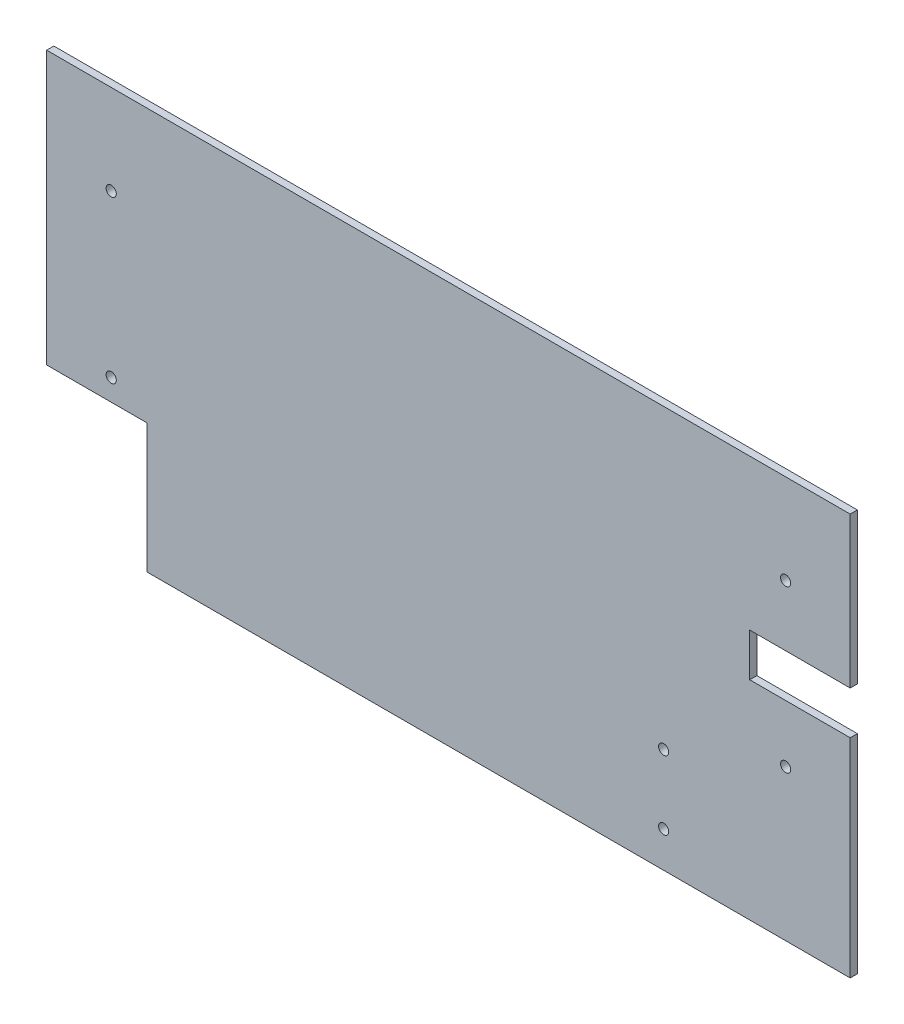
ISO-10303-21;
HEADER;
FILE_DESCRIPTION(('STEP AP214'),'2;1');
FILE_NAME('part.step','',(''),(''),'','','');
FILE_SCHEMA(('AUTOMOTIVE_DESIGN { 1 0 10303 214 1 1 1 1 }'));
ENDSEC;
DATA;
#1=APPLICATION_CONTEXT('core data for automotive mechanical design processes');
#2=APPLICATION_PROTOCOL_DEFINITION('international standard','automotive_design',2000,#1);
#3=PRODUCT_CONTEXT('',#1,'mechanical');
#4=PRODUCT('Part','Part','',(#3));
#5=PRODUCT_RELATED_PRODUCT_CATEGORY('part','',(#4));
#6=PRODUCT_DEFINITION_FORMATION('','',#4);
#7=PRODUCT_DEFINITION_CONTEXT('part definition',#1,'design');
#8=PRODUCT_DEFINITION('design','',#6,#7);
#9=PRODUCT_DEFINITION_SHAPE('','',#8);
#10=(LENGTH_UNIT() NAMED_UNIT(*) SI_UNIT(.MILLI.,.METRE.));
#11=(NAMED_UNIT(*) PLANE_ANGLE_UNIT() SI_UNIT($,.RADIAN.));
#12=(NAMED_UNIT(*) SI_UNIT($,.STERADIAN.) SOLID_ANGLE_UNIT());
#13=UNCERTAINTY_MEASURE_WITH_UNIT(LENGTH_MEASURE(1.E-05),#10,'distance_accuracy_value','');
#14=(GEOMETRIC_REPRESENTATION_CONTEXT(3) GLOBAL_UNCERTAINTY_ASSIGNED_CONTEXT((#13)) GLOBAL_UNIT_ASSIGNED_CONTEXT((#10,
#11,#12)) REPRESENTATION_CONTEXT('',''));
#15=CARTESIAN_POINT('',(0.,0.,0.));
#16=DIRECTION('',(0.,0.,1.));
#17=DIRECTION('',(1.,0.,0.));
#18=AXIS2_PLACEMENT_3D('',#15,#16,#17);
#19=CARTESIAN_POINT('',(0.,3.17499999999998,-3.175));
#20=DIRECTION('',(0.,1.,0.));
#21=DIRECTION('',(-1.,0.,0.));
#22=AXIS2_PLACEMENT_3D('',#19,#20,#21);
#23=PLANE('',#22);
#24=DIRECTION('',(-1.,0.,0.));
#25=VECTOR('',#24,1.);
#26=CARTESIAN_POINT('',(0.,3.17499999999998,0.));
#27=LINE('',#26,#25);
#28=CARTESIAN_POINT('',(177.8,3.17499999999997,0.));
#29=VERTEX_POINT('',#28);
#30=CARTESIAN_POINT('',(133.35,3.17499999999997,0.));
#31=VERTEX_POINT('',#30);
#32=EDGE_CURVE('E181',#29,#31,#27,.T.);
#33=ORIENTED_EDGE('',*,*,#32,.F.);
#34=DIRECTION('',(0.,0.,1.));
#35=VECTOR('',#34,1.);
#36=CARTESIAN_POINT('',(177.8,3.17499999999997,-3.175));
#37=LINE('',#36,#35);
#38=CARTESIAN_POINT('',(177.8,3.17499999999997,-3.175));
#39=VERTEX_POINT('',#38);
#40=EDGE_CURVE('E11',#39,#29,#37,.T.);
#41=ORIENTED_EDGE('',*,*,#40,.F.);
#42=DIRECTION('',(-1.,0.,0.));
#43=VECTOR('',#42,1.);
#44=CARTESIAN_POINT('',(0.,3.17499999999998,-3.175));
#45=LINE('',#44,#43);
#46=CARTESIAN_POINT('',(133.35,3.17499999999997,-3.175));
#47=VERTEX_POINT('',#46);
#48=EDGE_CURVE('E433',#39,#47,#45,.T.);
#49=ORIENTED_EDGE('',*,*,#48,.T.);
#50=DIRECTION('',(0.,0.,1.));
#51=VECTOR('',#50,1.);
#52=CARTESIAN_POINT('',(133.35,3.17499999999997,-3.175));
#53=LINE('',#52,#51);
#54=EDGE_CURVE('E43',#47,#31,#53,.T.);
#55=ORIENTED_EDGE('',*,*,#54,.T.);
#56=EDGE_LOOP('',(#33,#41,#49,#55));
#57=FACE_BOUND('',#56,.T.);
#58=ADVANCED_FACE('F39',(#57),#23,.T.);
#59=CARTESIAN_POINT('',(177.8,0.,-3.175));
#60=DIRECTION('',(1.,0.,0.));
#61=DIRECTION('',(0.,0.,-1.));
#62=AXIS2_PLACEMENT_3D('',#59,#60,#61);
#63=PLANE('',#62);
#64=DIRECTION('',(0.,1.,0.));
#65=VECTOR('',#64,1.);
#66=CARTESIAN_POINT('',(177.8,0.,0.));
#67=LINE('',#66,#65);
#68=CARTESIAN_POINT('',(177.8,-88.9,0.));
#69=VERTEX_POINT('',#68);
#70=EDGE_CURVE('E193',#69,#29,#67,.T.);
#71=ORIENTED_EDGE('',*,*,#70,.F.);
#72=DIRECTION('',(0.,0.,1.));
#73=VECTOR('',#72,1.);
#74=CARTESIAN_POINT('',(177.8,-88.9,-3.175));
#75=LINE('',#74,#73);
#76=CARTESIAN_POINT('',(177.8,-88.9,-3.175));
#77=VERTEX_POINT('',#76);
#78=EDGE_CURVE('E49',#77,#69,#75,.T.);
#79=ORIENTED_EDGE('',*,*,#78,.F.);
#80=DIRECTION('',(0.,1.,0.));
#81=VECTOR('',#80,1.);
#82=CARTESIAN_POINT('',(177.8,0.,-3.175));
#83=LINE('',#82,#81);
#84=EDGE_CURVE('E140',#77,#39,#83,.T.);
#85=ORIENTED_EDGE('',*,*,#84,.T.);
#86=ORIENTED_EDGE('',*,*,#40,.T.);
#87=EDGE_LOOP('',(#71,#79,#85,#86));
#88=FACE_BOUND('',#87,.T.);
#89=ADVANCED_FACE('F216',(#88),#63,.T.);
#90=CARTESIAN_POINT('',(0.,-88.9,-3.175));
#91=DIRECTION('',(0.,1.,0.));
#92=DIRECTION('',(-1.,0.,0.));
#93=AXIS2_PLACEMENT_3D('',#90,#91,#92);
#94=PLANE('',#93);
#95=DIRECTION('',(-1.,0.,0.));
#96=VECTOR('',#95,1.);
#97=CARTESIAN_POINT('',(0.,-88.9,0.));
#98=LINE('',#97,#96);
#99=CARTESIAN_POINT('',(-133.35,-88.9,0.));
#100=VERTEX_POINT('',#99);
#101=EDGE_CURVE('E143',#69,#100,#98,.T.);
#102=ORIENTED_EDGE('',*,*,#101,.T.);
#103=DIRECTION('',(0.,0.,1.));
#104=VECTOR('',#103,1.);
#105=CARTESIAN_POINT('',(-133.35,-88.9,-3.175));
#106=LINE('',#105,#104);
#107=CARTESIAN_POINT('',(-133.35,-88.9,-3.175));
#108=VERTEX_POINT('',#107);
#109=EDGE_CURVE('E129',#108,#100,#106,.T.);
#110=ORIENTED_EDGE('',*,*,#109,.F.);
#111=DIRECTION('',(-1.,0.,0.));
#112=VECTOR('',#111,1.);
#113=CARTESIAN_POINT('',(0.,-88.9,-3.175));
#114=LINE('',#113,#112);
#115=EDGE_CURVE('E134',#77,#108,#114,.T.);
#116=ORIENTED_EDGE('',*,*,#115,.F.);
#117=ORIENTED_EDGE('',*,*,#78,.T.);
#118=EDGE_LOOP('',(#102,#110,#116,#117));
#119=FACE_BOUND('',#118,.T.);
#120=ADVANCED_FACE('F142',(#119),#94,.F.);
#121=CARTESIAN_POINT('',(-133.35,0.,-3.175));
#122=DIRECTION('',(1.,0.,0.));
#123=DIRECTION('',(0.,0.,-1.));
#124=AXIS2_PLACEMENT_3D('',#121,#122,#123);
#125=PLANE('',#124);
#126=DIRECTION('',(0.,1.,0.));
#127=VECTOR('',#126,1.);
#128=CARTESIAN_POINT('',(-133.35,0.,0.));
#129=LINE('',#128,#127);
#130=CARTESIAN_POINT('',(-133.35,-31.7500000000001,0.));
#131=VERTEX_POINT('',#130);
#132=EDGE_CURVE('E202',#100,#131,#129,.T.);
#133=ORIENTED_EDGE('',*,*,#132,.T.);
#134=DIRECTION('',(0.,0.,1.));
#135=VECTOR('',#134,1.);
#136=CARTESIAN_POINT('',(-133.35,-31.7500000000001,-3.175));
#137=LINE('',#136,#135);
#138=CARTESIAN_POINT('',(-133.35,-31.7500000000001,-3.175));
#139=VERTEX_POINT('',#138);
#140=EDGE_CURVE('E130',#139,#131,#137,.T.);
#141=ORIENTED_EDGE('',*,*,#140,.F.);
#142=DIRECTION('',(0.,1.,0.));
#143=VECTOR('',#142,1.);
#144=CARTESIAN_POINT('',(-133.35,0.,-3.175));
#145=LINE('',#144,#143);
#146=EDGE_CURVE('E124',#108,#139,#145,.T.);
#147=ORIENTED_EDGE('',*,*,#146,.F.);
#148=ORIENTED_EDGE('',*,*,#109,.T.);
#149=EDGE_LOOP('',(#133,#141,#147,#148));
#150=FACE_BOUND('',#149,.T.);
#151=ADVANCED_FACE('F127',(#150),#125,.F.);
#152=CARTESIAN_POINT('',(0.,-31.7500000000001,-3.175));
#153=DIRECTION('',(0.,-1.,0.));
#154=DIRECTION('',(1.,0.,0.));
#155=AXIS2_PLACEMENT_3D('',#152,#153,#154);
#156=PLANE('',#155);
#157=DIRECTION('',(1.,0.,0.));
#158=VECTOR('',#157,1.);
#159=CARTESIAN_POINT('',(0.,-31.7500000000001,0.));
#160=LINE('',#159,#158);
#161=CARTESIAN_POINT('',(-177.8,-31.7500000000001,0.));
#162=VERTEX_POINT('',#161);
#163=EDGE_CURVE('E199',#162,#131,#160,.T.);
#164=ORIENTED_EDGE('',*,*,#163,.F.);
#165=DIRECTION('',(0.,0.,1.));
#166=VECTOR('',#165,1.);
#167=CARTESIAN_POINT('',(-177.8,-31.7500000000001,-3.175));
#168=LINE('',#167,#166);
#169=CARTESIAN_POINT('',(-177.8,-31.7500000000001,-3.175));
#170=VERTEX_POINT('',#169);
#171=EDGE_CURVE('E146',#170,#162,#168,.T.);
#172=ORIENTED_EDGE('',*,*,#171,.F.);
#173=DIRECTION('',(1.,0.,0.));
#174=VECTOR('',#173,1.);
#175=CARTESIAN_POINT('',(0.,-31.7500000000001,-3.175));
#176=LINE('',#175,#174);
#177=EDGE_CURVE('E135',#170,#139,#176,.T.);
#178=ORIENTED_EDGE('',*,*,#177,.T.);
#179=ORIENTED_EDGE('',*,*,#140,.T.);
#180=EDGE_LOOP('',(#164,#172,#178,#179));
#181=FACE_BOUND('',#180,.T.);
#182=ADVANCED_FACE('F261',(#181),#156,.T.);
#183=CARTESIAN_POINT('',(-177.8,0.,-3.175));
#184=DIRECTION('',(1.,0.,0.));
#185=DIRECTION('',(0.,0.,-1.));
#186=AXIS2_PLACEMENT_3D('',#183,#184,#185);
#187=PLANE('',#186);
#188=DIRECTION('',(0.,1.,0.));
#189=VECTOR('',#188,1.);
#190=CARTESIAN_POINT('',(-177.8,0.,0.));
#191=LINE('',#190,#189);
#192=CARTESIAN_POINT('',(-177.8,88.8999999999999,0.));
#193=VERTEX_POINT('',#192);
#194=EDGE_CURVE('E196',#162,#193,#191,.T.);
#195=ORIENTED_EDGE('',*,*,#194,.T.);
#196=DIRECTION('',(0.,0.,1.));
#197=VECTOR('',#196,1.);
#198=CARTESIAN_POINT('',(-177.8,88.8999999999999,-3.175));
#199=LINE('',#198,#197);
#200=CARTESIAN_POINT('',(-177.8,88.8999999999999,-3.175));
#201=VERTEX_POINT('',#200);
#202=EDGE_CURVE('E150',#201,#193,#199,.T.);
#203=ORIENTED_EDGE('',*,*,#202,.F.);
#204=DIRECTION('',(0.,1.,0.));
#205=VECTOR('',#204,1.);
#206=CARTESIAN_POINT('',(-177.8,0.,-3.175));
#207=LINE('',#206,#205);
#208=EDGE_CURVE('E254',#170,#201,#207,.T.);
#209=ORIENTED_EDGE('',*,*,#208,.F.);
#210=ORIENTED_EDGE('',*,*,#171,.T.);
#211=EDGE_LOOP('',(#195,#203,#209,#210));
#212=FACE_BOUND('',#211,.T.);
#213=ADVANCED_FACE('F238',(#212),#187,.F.);
#214=CARTESIAN_POINT('',(0.,88.8999999999999,-3.175));
#215=DIRECTION('',(0.,1.,0.));
#216=DIRECTION('',(-1.,0.,0.));
#217=AXIS2_PLACEMENT_3D('',#214,#215,#216);
#218=PLANE('',#217);
#219=DIRECTION('',(-1.,0.,0.));
#220=VECTOR('',#219,1.);
#221=CARTESIAN_POINT('',(0.,88.8999999999999,0.));
#222=LINE('',#221,#220);
#223=CARTESIAN_POINT('',(177.8,88.9,0.));
#224=VERTEX_POINT('',#223);
#225=EDGE_CURVE('E192',#224,#193,#222,.T.);
#226=ORIENTED_EDGE('',*,*,#225,.F.);
#227=DIRECTION('',(0.,0.,1.));
#228=VECTOR('',#227,1.);
#229=CARTESIAN_POINT('',(177.8,88.9,-3.175));
#230=LINE('',#229,#228);
#231=CARTESIAN_POINT('',(177.8,88.9,-3.175));
#232=VERTEX_POINT('',#231);
#233=EDGE_CURVE('E152',#232,#224,#230,.T.);
#234=ORIENTED_EDGE('',*,*,#233,.F.);
#235=DIRECTION('',(-1.,0.,0.));
#236=VECTOR('',#235,1.);
#237=CARTESIAN_POINT('',(0.,88.8999999999999,-3.175));
#238=LINE('',#237,#236);
#239=EDGE_CURVE('E253',#232,#201,#238,.T.);
#240=ORIENTED_EDGE('',*,*,#239,.T.);
#241=ORIENTED_EDGE('',*,*,#202,.T.);
#242=EDGE_LOOP('',(#226,#234,#240,#241));
#243=FACE_BOUND('',#242,.T.);
#244=ADVANCED_FACE('F229',(#243),#218,.T.);
#245=CARTESIAN_POINT('',(177.8,22.225,0.));
#246=VERTEX_POINT('',#245);
#247=EDGE_CURVE('E189',#246,#224,#67,.T.);
#248=ORIENTED_EDGE('',*,*,#247,.F.);
#249=DIRECTION('',(0.,0.,1.));
#250=VECTOR('',#249,1.);
#251=CARTESIAN_POINT('',(177.8,22.225,-3.175));
#252=LINE('',#251,#250);
#253=CARTESIAN_POINT('',(177.8,22.225,-3.175));
#254=VERTEX_POINT('',#253);
#255=EDGE_CURVE('E154',#254,#246,#252,.T.);
#256=ORIENTED_EDGE('',*,*,#255,.F.);
#257=EDGE_CURVE('E164',#254,#232,#83,.T.);
#258=ORIENTED_EDGE('',*,*,#257,.T.);
#259=ORIENTED_EDGE('',*,*,#233,.T.);
#260=EDGE_LOOP('',(#248,#256,#258,#259));
#261=FACE_BOUND('',#260,.T.);
#262=ADVANCED_FACE('F219',(#261),#63,.T.);
#263=CARTESIAN_POINT('',(0.,22.2249999999999,-3.175));
#264=DIRECTION('',(0.,1.,0.));
#265=DIRECTION('',(-1.,0.,0.));
#266=AXIS2_PLACEMENT_3D('',#263,#264,#265);
#267=PLANE('',#266);
#268=DIRECTION('',(-1.,0.,0.));
#269=VECTOR('',#268,1.);
#270=CARTESIAN_POINT('',(0.,22.2249999999999,0.));
#271=LINE('',#270,#269);
#272=CARTESIAN_POINT('',(133.35,22.225,0.));
#273=VERTEX_POINT('',#272);
#274=EDGE_CURVE('E187',#246,#273,#271,.T.);
#275=ORIENTED_EDGE('',*,*,#274,.T.);
#276=DIRECTION('',(0.,0.,1.));
#277=VECTOR('',#276,1.);
#278=CARTESIAN_POINT('',(133.35,22.225,-3.175));
#279=LINE('',#278,#277);
#280=CARTESIAN_POINT('',(133.35,22.225,-3.175));
#281=VERTEX_POINT('',#280);
#282=EDGE_CURVE('E155',#281,#273,#279,.T.);
#283=ORIENTED_EDGE('',*,*,#282,.F.);
#284=DIRECTION('',(-1.,0.,0.));
#285=VECTOR('',#284,1.);
#286=CARTESIAN_POINT('',(0.,22.2249999999999,-3.175));
#287=LINE('',#286,#285);
#288=EDGE_CURVE('E247',#254,#281,#287,.T.);
#289=ORIENTED_EDGE('',*,*,#288,.F.);
#290=ORIENTED_EDGE('',*,*,#255,.T.);
#291=EDGE_LOOP('',(#275,#283,#289,#290));
#292=FACE_BOUND('',#291,.T.);
#293=ADVANCED_FACE('F228',(#292),#267,.F.);
#294=CARTESIAN_POINT('',(133.35,0.,-3.175));
#295=DIRECTION('',(1.,0.,0.));
#296=DIRECTION('',(0.,0.,-1.));
#297=AXIS2_PLACEMENT_3D('',#294,#295,#296);
#298=PLANE('',#297);
#299=DIRECTION('',(0.,1.,0.));
#300=VECTOR('',#299,1.);
#301=CARTESIAN_POINT('',(133.35,0.,0.));
#302=LINE('',#301,#300);
#303=EDGE_CURVE('E184',#31,#273,#302,.T.);
#304=ORIENTED_EDGE('',*,*,#303,.F.);
#305=ORIENTED_EDGE('',*,*,#54,.F.);
#306=DIRECTION('',(0.,1.,0.));
#307=VECTOR('',#306,1.);
#308=CARTESIAN_POINT('',(133.35,0.,-3.175));
#309=LINE('',#308,#307);
#310=EDGE_CURVE('E249',#47,#281,#309,.T.);
#311=ORIENTED_EDGE('',*,*,#310,.T.);
#312=ORIENTED_EDGE('',*,*,#282,.T.);
#313=EDGE_LOOP('',(#304,#305,#311,#312));
#314=FACE_BOUND('',#313,.T.);
#315=ADVANCED_FACE('F235',(#314),#298,.T.);
#316=CARTESIAN_POINT('',(-149.225,49.2125,-3.175));
#317=DIRECTION('',(0.,0.,1.));
#318=DIRECTION('',(1.,0.,0.));
#319=AXIS2_PLACEMENT_3D('',#316,#317,#318);
#320=CYLINDRICAL_SURFACE('',#319,2.25000000000001);
#321=CARTESIAN_POINT('',(-149.225,49.2125,-3.175));
#322=DIRECTION('',(0.,0.,1.));
#323=DIRECTION('',(1.,0.,0.));
#324=AXIS2_PLACEMENT_3D('',#321,#322,#323);
#325=CIRCLE('',#324,2.25000000000001);
#326=CARTESIAN_POINT('',(-146.975,49.2125,-3.175));
#327=VERTEX_POINT('',#326);
#328=EDGE_CURVE('E432',#327,#327,#325,.T.);
#329=ORIENTED_EDGE('',*,*,#328,.F.);
#330=EDGE_LOOP('',(#329));
#331=FACE_BOUND('',#330,.T.);
#332=CARTESIAN_POINT('',(-149.225,49.2125,0.));
#333=DIRECTION('',(0.,0.,1.));
#334=DIRECTION('',(1.,0.,0.));
#335=AXIS2_PLACEMENT_3D('',#332,#333,#334);
#336=CIRCLE('',#335,2.25000000000001);
#337=CARTESIAN_POINT('',(-146.975,49.2125,0.));
#338=VERTEX_POINT('',#337);
#339=EDGE_CURVE('E178',#338,#338,#336,.T.);
#340=ORIENTED_EDGE('',*,*,#339,.T.);
#341=EDGE_LOOP('',(#340));
#342=FACE_BOUND('',#341,.T.);
#343=ADVANCED_FACE('F274',(#331,#342),#320,.F.);
#344=CARTESIAN_POINT('',(-149.225,-22.2250000000001,-3.175));
#345=DIRECTION('',(0.,0.,1.));
#346=DIRECTION('',(1.,0.,0.));
#347=AXIS2_PLACEMENT_3D('',#344,#345,#346);
#348=CYLINDRICAL_SURFACE('',#347,2.25000000000001);
#349=CARTESIAN_POINT('',(-149.225,-22.2250000000001,-3.175));
#350=DIRECTION('',(0.,0.,1.));
#351=DIRECTION('',(1.,0.,0.));
#352=AXIS2_PLACEMENT_3D('',#349,#350,#351);
#353=CIRCLE('',#352,2.25000000000001);
#354=CARTESIAN_POINT('',(-146.975,-22.2250000000001,-3.175));
#355=VERTEX_POINT('',#354);
#356=EDGE_CURVE('E429',#355,#355,#353,.T.);
#357=ORIENTED_EDGE('',*,*,#356,.F.);
#358=EDGE_LOOP('',(#357));
#359=FACE_BOUND('',#358,.T.);
#360=CARTESIAN_POINT('',(-149.225,-22.2250000000001,0.));
#361=DIRECTION('',(0.,0.,1.));
#362=DIRECTION('',(1.,0.,0.));
#363=AXIS2_PLACEMENT_3D('',#360,#361,#362);
#364=CIRCLE('',#363,2.25000000000001);
#365=CARTESIAN_POINT('',(-146.975,-22.2250000000001,0.));
#366=VERTEX_POINT('',#365);
#367=EDGE_CURVE('E175',#366,#366,#364,.T.);
#368=ORIENTED_EDGE('',*,*,#367,.T.);
#369=EDGE_LOOP('',(#368));
#370=FACE_BOUND('',#369,.T.);
#371=ADVANCED_FACE('F278',(#359,#370),#348,.F.);
#372=CARTESIAN_POINT('',(149.225,49.2125,-3.175));
#373=DIRECTION('',(0.,0.,1.));
#374=DIRECTION('',(1.,0.,0.));
#375=AXIS2_PLACEMENT_3D('',#372,#373,#374);
#376=CYLINDRICAL_SURFACE('',#375,2.25000000000001);
#377=CARTESIAN_POINT('',(149.225,49.2125,-3.175));
#378=DIRECTION('',(0.,0.,1.));
#379=DIRECTION('',(1.,0.,0.));
#380=AXIS2_PLACEMENT_3D('',#377,#378,#379);
#381=CIRCLE('',#380,2.25000000000001);
#382=CARTESIAN_POINT('',(151.475,49.2125,-3.175));
#383=VERTEX_POINT('',#382);
#384=EDGE_CURVE('E425',#383,#383,#381,.F.);
#385=ORIENTED_EDGE('',*,*,#384,.T.);
#386=EDGE_LOOP('',(#385));
#387=FACE_BOUND('',#386,.T.);
#388=CARTESIAN_POINT('',(149.225,49.2125,0.));
#389=DIRECTION('',(0.,0.,1.));
#390=DIRECTION('',(1.,0.,0.));
#391=AXIS2_PLACEMENT_3D('',#388,#389,#390);
#392=CIRCLE('',#391,2.25000000000001);
#393=CARTESIAN_POINT('',(151.475,49.2125,0.));
#394=VERTEX_POINT('',#393);
#395=EDGE_CURVE('E172',#394,#394,#392,.F.);
#396=ORIENTED_EDGE('',*,*,#395,.F.);
#397=EDGE_LOOP('',(#396));
#398=FACE_BOUND('',#397,.T.);
#399=ADVANCED_FACE('F282',(#387,#398),#376,.F.);
#400=CARTESIAN_POINT('',(95.25,-73.025,-3.175));
#401=DIRECTION('',(0.,0.,1.));
#402=DIRECTION('',(1.,0.,0.));
#403=AXIS2_PLACEMENT_3D('',#400,#401,#402);
#404=CYLINDRICAL_SURFACE('',#403,2.25);
#405=CARTESIAN_POINT('',(95.25,-73.025,-3.175));
#406=DIRECTION('',(0.,0.,1.));
#407=DIRECTION('',(1.,0.,0.));
#408=AXIS2_PLACEMENT_3D('',#405,#406,#407);
#409=CIRCLE('',#408,2.25);
#410=CARTESIAN_POINT('',(97.5,-73.025,-3.175));
#411=VERTEX_POINT('',#410);
#412=EDGE_CURVE('E211',#411,#411,#409,.T.);
#413=ORIENTED_EDGE('',*,*,#412,.F.);
#414=EDGE_LOOP('',(#413));
#415=FACE_BOUND('',#414,.T.);
#416=CARTESIAN_POINT('',(95.25,-73.025,0.));
#417=DIRECTION('',(0.,0.,1.));
#418=DIRECTION('',(1.,0.,0.));
#419=AXIS2_PLACEMENT_3D('',#416,#417,#418);
#420=CIRCLE('',#419,2.25);
#421=CARTESIAN_POINT('',(97.5,-73.025,0.));
#422=VERTEX_POINT('',#421);
#423=EDGE_CURVE('E169',#422,#422,#420,.T.);
#424=ORIENTED_EDGE('',*,*,#423,.T.);
#425=EDGE_LOOP('',(#424));
#426=FACE_BOUND('',#425,.T.);
#427=ADVANCED_FACE('F285',(#415,#426),#404,.F.);
#428=CARTESIAN_POINT('',(95.25,-42.545,-3.175));
#429=DIRECTION('',(0.,0.,1.));
#430=DIRECTION('',(1.,0.,0.));
#431=AXIS2_PLACEMENT_3D('',#428,#429,#430);
#432=CYLINDRICAL_SURFACE('',#431,2.25);
#433=CARTESIAN_POINT('',(95.25,-42.545,-3.175));
#434=DIRECTION('',(0.,0.,1.));
#435=DIRECTION('',(1.,0.,0.));
#436=AXIS2_PLACEMENT_3D('',#433,#434,#435);
#437=CIRCLE('',#436,2.25);
#438=CARTESIAN_POINT('',(97.5,-42.545,-3.175));
#439=VERTEX_POINT('',#438);
#440=EDGE_CURVE('E207',#439,#439,#437,.T.);
#441=ORIENTED_EDGE('',*,*,#440,.F.);
#442=EDGE_LOOP('',(#441));
#443=FACE_BOUND('',#442,.T.);
#444=CARTESIAN_POINT('',(95.25,-42.545,0.));
#445=DIRECTION('',(0.,0.,1.));
#446=DIRECTION('',(1.,0.,0.));
#447=AXIS2_PLACEMENT_3D('',#444,#445,#446);
#448=CIRCLE('',#447,2.25);
#449=CARTESIAN_POINT('',(97.5,-42.545,0.));
#450=VERTEX_POINT('',#449);
#451=EDGE_CURVE('E166',#450,#450,#448,.T.);
#452=ORIENTED_EDGE('',*,*,#451,.T.);
#453=EDGE_LOOP('',(#452));
#454=FACE_BOUND('',#453,.T.);
#455=ADVANCED_FACE('F41',(#443,#454),#432,.F.);
#456=CARTESIAN_POINT('',(149.225,-22.225,-3.175));
#457=DIRECTION('',(0.,0.,1.));
#458=DIRECTION('',(1.,0.,0.));
#459=AXIS2_PLACEMENT_3D('',#456,#457,#458);
#460=CYLINDRICAL_SURFACE('',#459,2.25000000000001);
#461=CARTESIAN_POINT('',(149.225,-22.225,-3.175));
#462=DIRECTION('',(0.,0.,1.));
#463=DIRECTION('',(1.,0.,0.));
#464=AXIS2_PLACEMENT_3D('',#461,#462,#463);
#465=CIRCLE('',#464,2.25000000000001);
#466=CARTESIAN_POINT('',(151.475,-22.225,-3.175));
#467=VERTEX_POINT('',#466);
#468=EDGE_CURVE('E158',#467,#467,#465,.F.);
#469=ORIENTED_EDGE('',*,*,#468,.T.);
#470=EDGE_LOOP('',(#469));
#471=FACE_BOUND('',#470,.T.);
#472=CARTESIAN_POINT('',(149.225,-22.225,0.));
#473=DIRECTION('',(0.,0.,1.));
#474=DIRECTION('',(1.,0.,0.));
#475=AXIS2_PLACEMENT_3D('',#472,#473,#474);
#476=CIRCLE('',#475,2.25000000000001);
#477=CARTESIAN_POINT('',(151.475,-22.225,0.));
#478=VERTEX_POINT('',#477);
#479=EDGE_CURVE('E205',#478,#478,#476,.F.);
#480=ORIENTED_EDGE('',*,*,#479,.F.);
#481=EDGE_LOOP('',(#480));
#482=FACE_BOUND('',#481,.T.);
#483=ADVANCED_FACE('F292',(#471,#482),#460,.F.);
#484=CARTESIAN_POINT('',(0.,0.,-3.175));
#485=DIRECTION('',(0.,0.,1.));
#486=DIRECTION('',(1.,0.,0.));
#487=AXIS2_PLACEMENT_3D('',#484,#485,#486);
#488=PLANE('',#487);
#489=ORIENTED_EDGE('',*,*,#440,.T.);
#490=EDGE_LOOP('',(#489));
#491=FACE_BOUND('',#490,.T.);
#492=ORIENTED_EDGE('',*,*,#412,.T.);
#493=EDGE_LOOP('',(#492));
#494=FACE_BOUND('',#493,.T.);
#495=ORIENTED_EDGE('',*,*,#384,.F.);
#496=EDGE_LOOP('',(#495));
#497=FACE_BOUND('',#496,.T.);
#498=ORIENTED_EDGE('',*,*,#356,.T.);
#499=EDGE_LOOP('',(#498));
#500=FACE_BOUND('',#499,.T.);
#501=ORIENTED_EDGE('',*,*,#328,.T.);
#502=EDGE_LOOP('',(#501));
#503=FACE_BOUND('',#502,.T.);
#504=ORIENTED_EDGE('',*,*,#48,.F.);
#505=ORIENTED_EDGE('',*,*,#84,.F.);
#506=ORIENTED_EDGE('',*,*,#115,.T.);
#507=ORIENTED_EDGE('',*,*,#146,.T.);
#508=ORIENTED_EDGE('',*,*,#177,.F.);
#509=ORIENTED_EDGE('',*,*,#208,.T.);
#510=ORIENTED_EDGE('',*,*,#239,.F.);
#511=ORIENTED_EDGE('',*,*,#257,.F.);
#512=ORIENTED_EDGE('',*,*,#288,.T.);
#513=ORIENTED_EDGE('',*,*,#310,.F.);
#514=EDGE_LOOP('',(#504,#505,#506,#507,#508,#509,#510,#511,#512,#513));
#515=FACE_BOUND('',#514,.T.);
#516=ORIENTED_EDGE('',*,*,#468,.F.);
#517=EDGE_LOOP('',(#516));
#518=FACE_BOUND('',#517,.T.);
#519=ADVANCED_FACE('F138',(#491,#494,#497,#500,#503,#515,#518),#488,.F.);
#520=CARTESIAN_POINT('',(0.,0.,0.));
#521=DIRECTION('',(0.,0.,1.));
#522=DIRECTION('',(1.,0.,0.));
#523=AXIS2_PLACEMENT_3D('',#520,#521,#522);
#524=PLANE('',#523);
#525=ORIENTED_EDGE('',*,*,#451,.F.);
#526=EDGE_LOOP('',(#525));
#527=FACE_BOUND('',#526,.T.);
#528=ORIENTED_EDGE('',*,*,#423,.F.);
#529=EDGE_LOOP('',(#528));
#530=FACE_BOUND('',#529,.T.);
#531=ORIENTED_EDGE('',*,*,#395,.T.);
#532=EDGE_LOOP('',(#531));
#533=FACE_BOUND('',#532,.T.);
#534=ORIENTED_EDGE('',*,*,#367,.F.);
#535=EDGE_LOOP('',(#534));
#536=FACE_BOUND('',#535,.T.);
#537=ORIENTED_EDGE('',*,*,#339,.F.);
#538=EDGE_LOOP('',(#537));
#539=FACE_BOUND('',#538,.T.);
#540=ORIENTED_EDGE('',*,*,#32,.T.);
#541=ORIENTED_EDGE('',*,*,#303,.T.);
#542=ORIENTED_EDGE('',*,*,#274,.F.);
#543=ORIENTED_EDGE('',*,*,#247,.T.);
#544=ORIENTED_EDGE('',*,*,#225,.T.);
#545=ORIENTED_EDGE('',*,*,#194,.F.);
#546=ORIENTED_EDGE('',*,*,#163,.T.);
#547=ORIENTED_EDGE('',*,*,#132,.F.);
#548=ORIENTED_EDGE('',*,*,#101,.F.);
#549=ORIENTED_EDGE('',*,*,#70,.T.);
#550=EDGE_LOOP('',(#540,#541,#542,#543,#544,#545,#546,#547,#548,#549));
#551=FACE_BOUND('',#550,.T.);
#552=ORIENTED_EDGE('',*,*,#479,.T.);
#553=EDGE_LOOP('',(#552));
#554=FACE_BOUND('',#553,.T.);
#555=ADVANCED_FACE('F215',(#527,#530,#533,#536,#539,#551,#554),#524,.T.);
#556=CLOSED_SHELL('',(#58,#89,#120,#151,#182,#213,#244,#262,#293,#315,#343,#371,#399,#427,#455,
#483,#519,#555));
#557=MANIFOLD_SOLID_BREP('B2',#556);
#558=ADVANCED_BREP_SHAPE_REPRESENTATION('',(#18,#557),#14);
#559=SHAPE_DEFINITION_REPRESENTATION(#9,#558);
ENDSEC;
END-ISO-10303-21;
